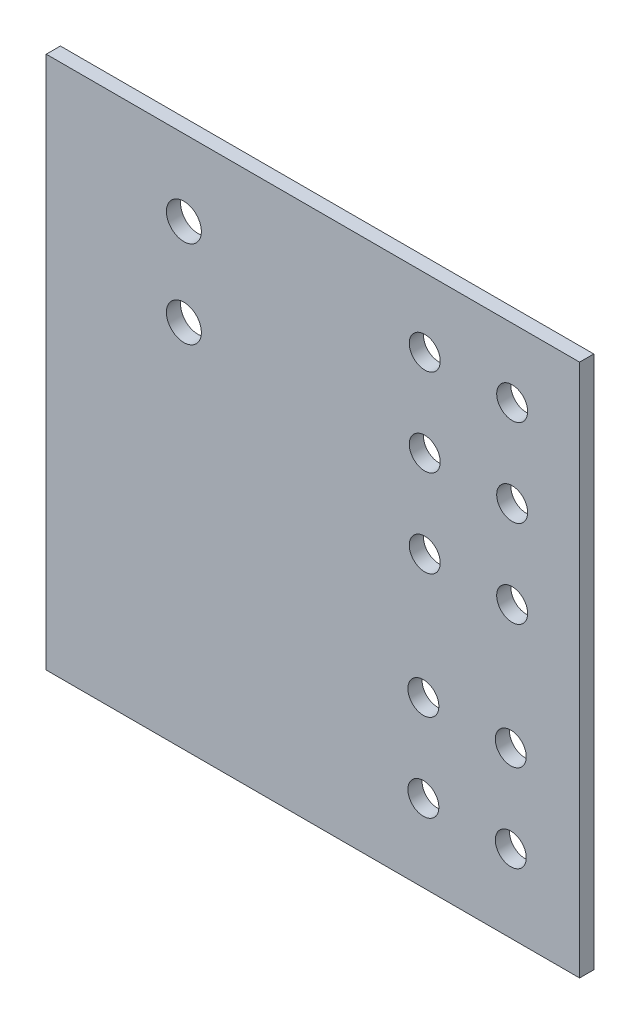
ISO-10303-21;
HEADER;
FILE_DESCRIPTION(('STEP AP214'),'2;1');
FILE_NAME('part.step','',(''),(''),'','','');
FILE_SCHEMA(('AUTOMOTIVE_DESIGN { 1 0 10303 214 1 1 1 1 }'));
ENDSEC;
DATA;
#1=APPLICATION_CONTEXT('core data for automotive mechanical design processes');
#2=APPLICATION_PROTOCOL_DEFINITION('international standard','automotive_design',2000,#1);
#3=PRODUCT_CONTEXT('',#1,'mechanical');
#4=PRODUCT('Part','Part','',(#3));
#5=PRODUCT_RELATED_PRODUCT_CATEGORY('part','',(#4));
#6=PRODUCT_DEFINITION_FORMATION('','',#4);
#7=PRODUCT_DEFINITION_CONTEXT('part definition',#1,'design');
#8=PRODUCT_DEFINITION('design','',#6,#7);
#9=PRODUCT_DEFINITION_SHAPE('','',#8);
#10=(LENGTH_UNIT() NAMED_UNIT(*) SI_UNIT(.MILLI.,.METRE.));
#11=(NAMED_UNIT(*) PLANE_ANGLE_UNIT() SI_UNIT($,.RADIAN.));
#12=(NAMED_UNIT(*) SI_UNIT($,.STERADIAN.) SOLID_ANGLE_UNIT());
#13=UNCERTAINTY_MEASURE_WITH_UNIT(LENGTH_MEASURE(1.E-05),#10,'distance_accuracy_value','');
#14=(GEOMETRIC_REPRESENTATION_CONTEXT(3) GLOBAL_UNCERTAINTY_ASSIGNED_CONTEXT((#13)) GLOBAL_UNIT_ASSIGNED_CONTEXT((#10,
#11,#12)) REPRESENTATION_CONTEXT('',''));
#15=CARTESIAN_POINT('',(0.,0.,0.));
#16=DIRECTION('',(0.,0.,1.));
#17=DIRECTION('',(1.,0.,0.));
#18=AXIS2_PLACEMENT_3D('',#15,#16,#17);
#19=CARTESIAN_POINT('',(0.,5.00000016,0.41148));
#20=DIRECTION('',(0.,0.,-1.));
#21=DIRECTION('',(-1.,0.,0.));
#22=AXIS2_PLACEMENT_3D('',#19,#20,#21);
#23=PLANE('',#22);
#24=CARTESIAN_POINT('',(13.54002626,13.5000238,0.41148));
#25=DIRECTION('',(0.,0.,-1.));
#26=DIRECTION('',(-1.,0.,0.));
#27=AXIS2_PLACEMENT_3D('',#24,#25,#26);
#28=CIRCLE('',#27,0.4499991);
#29=CARTESIAN_POINT('',(13.09002716,13.5000238,0.41148));
#30=VERTEX_POINT('',#29);
#31=EDGE_CURVE('E131',#30,#30,#28,.T.);
#32=ORIENTED_EDGE('',*,*,#31,.T.);
#33=EDGE_LOOP('',(#32));
#34=FACE_BOUND('',#33,.T.);
#35=CARTESIAN_POINT('',(13.54002626,10.9600238,0.41148));
#36=DIRECTION('',(0.,0.,-1.));
#37=DIRECTION('',(-1.,0.,0.));
#38=AXIS2_PLACEMENT_3D('',#35,#36,#37);
#39=CIRCLE('',#38,0.4499991);
#40=CARTESIAN_POINT('',(13.09002716,10.9600238,0.41148));
#41=VERTEX_POINT('',#40);
#42=EDGE_CURVE('E134',#41,#41,#39,.T.);
#43=ORIENTED_EDGE('',*,*,#42,.T.);
#44=EDGE_LOOP('',(#43));
#45=FACE_BOUND('',#44,.T.);
#46=CARTESIAN_POINT('',(11.00002626,10.9600238,0.41148));
#47=DIRECTION('',(0.,0.,-1.));
#48=DIRECTION('',(-1.,0.,0.));
#49=AXIS2_PLACEMENT_3D('',#46,#47,#48);
#50=CIRCLE('',#49,0.4499991);
#51=CARTESIAN_POINT('',(10.55002716,10.9600238,0.41148));
#52=VERTEX_POINT('',#51);
#53=EDGE_CURVE('E137',#52,#52,#50,.T.);
#54=ORIENTED_EDGE('',*,*,#53,.T.);
#55=EDGE_LOOP('',(#54));
#56=FACE_BOUND('',#55,.T.);
#57=CARTESIAN_POINT('',(13.54002626,8.4200238,0.41148));
#58=DIRECTION('',(0.,0.,-1.));
#59=DIRECTION('',(-1.,0.,0.));
#60=AXIS2_PLACEMENT_3D('',#57,#58,#59);
#61=CIRCLE('',#60,0.4499991);
#62=CARTESIAN_POINT('',(13.09002716,8.4200238,0.41148));
#63=VERTEX_POINT('',#62);
#64=EDGE_CURVE('E140',#63,#63,#61,.T.);
#65=ORIENTED_EDGE('',*,*,#64,.T.);
#66=EDGE_LOOP('',(#65));
#67=FACE_BOUND('',#66,.T.);
#68=CARTESIAN_POINT('',(13.49999586,4.7900082,0.41148));
#69=DIRECTION('',(0.,0.,-1.));
#70=DIRECTION('',(-1.,0.,0.));
#71=AXIS2_PLACEMENT_3D('',#68,#69,#70);
#72=CIRCLE('',#71,0.4499991);
#73=CARTESIAN_POINT('',(13.04999676,4.7900082,0.41148));
#74=VERTEX_POINT('',#73);
#75=EDGE_CURVE('E143',#74,#74,#72,.T.);
#76=ORIENTED_EDGE('',*,*,#75,.T.);
#77=EDGE_LOOP('',(#76));
#78=FACE_BOUND('',#77,.T.);
#79=CARTESIAN_POINT('',(13.49999586,2.2500082,0.41148));
#80=DIRECTION('',(0.,0.,-1.));
#81=DIRECTION('',(-1.,0.,0.));
#82=AXIS2_PLACEMENT_3D('',#79,#80,#81);
#83=CIRCLE('',#82,0.4499991);
#84=CARTESIAN_POINT('',(13.04999676,2.2500082,0.41148));
#85=VERTEX_POINT('',#84);
#86=EDGE_CURVE('E146',#85,#85,#83,.T.);
#87=ORIENTED_EDGE('',*,*,#86,.T.);
#88=EDGE_LOOP('',(#87));
#89=FACE_BOUND('',#88,.T.);
#90=CARTESIAN_POINT('',(11.00002626,13.5000238,0.41148));
#91=DIRECTION('',(0.,0.,-1.));
#92=DIRECTION('',(-1.,0.,0.));
#93=AXIS2_PLACEMENT_3D('',#90,#91,#92);
#94=CIRCLE('',#93,0.4499991);
#95=CARTESIAN_POINT('',(10.55002716,13.5000238,0.41148));
#96=VERTEX_POINT('',#95);
#97=EDGE_CURVE('E149',#96,#96,#94,.T.);
#98=ORIENTED_EDGE('',*,*,#97,.T.);
#99=EDGE_LOOP('',(#98));
#100=FACE_BOUND('',#99,.T.);
#101=CARTESIAN_POINT('',(3.99998946,13.2900166,0.41148));
#102=DIRECTION('',(0.,0.,-1.));
#103=DIRECTION('',(-1.,0.,0.));
#104=AXIS2_PLACEMENT_3D('',#101,#102,#103);
#105=CIRCLE('',#104,0.508);
#106=CARTESIAN_POINT('',(3.49198946,13.2900166,0.41148));
#107=VERTEX_POINT('',#106);
#108=EDGE_CURVE('E152',#107,#107,#105,.T.);
#109=ORIENTED_EDGE('',*,*,#108,.T.);
#110=EDGE_LOOP('',(#109));
#111=FACE_BOUND('',#110,.T.);
#112=CARTESIAN_POINT('',(3.99998946,10.7500166,0.41148));
#113=DIRECTION('',(0.,0.,-1.));
#114=DIRECTION('',(-1.,0.,0.));
#115=AXIS2_PLACEMENT_3D('',#112,#113,#114);
#116=CIRCLE('',#115,0.508);
#117=CARTESIAN_POINT('',(3.49198946,10.7500166,0.41148));
#118=VERTEX_POINT('',#117);
#119=EDGE_CURVE('E155',#118,#118,#116,.T.);
#120=ORIENTED_EDGE('',*,*,#119,.T.);
#121=EDGE_LOOP('',(#120));
#122=FACE_BOUND('',#121,.T.);
#123=CARTESIAN_POINT('',(11.00002626,8.4200238,0.41148));
#124=DIRECTION('',(0.,0.,-1.));
#125=DIRECTION('',(-1.,0.,0.));
#126=AXIS2_PLACEMENT_3D('',#123,#124,#125);
#127=CIRCLE('',#126,0.4499991);
#128=CARTESIAN_POINT('',(10.55002716,8.4200238,0.41148));
#129=VERTEX_POINT('',#128);
#130=EDGE_CURVE('E158',#129,#129,#127,.T.);
#131=ORIENTED_EDGE('',*,*,#130,.T.);
#132=EDGE_LOOP('',(#131));
#133=FACE_BOUND('',#132,.T.);
#134=CARTESIAN_POINT('',(10.95999586,4.7900082,0.41148));
#135=DIRECTION('',(0.,0.,-1.));
#136=DIRECTION('',(-1.,0.,0.));
#137=AXIS2_PLACEMENT_3D('',#134,#135,#136);
#138=CIRCLE('',#137,0.4499991);
#139=CARTESIAN_POINT('',(10.50999676,4.7900082,0.41148));
#140=VERTEX_POINT('',#139);
#141=EDGE_CURVE('E161',#140,#140,#138,.T.);
#142=ORIENTED_EDGE('',*,*,#141,.T.);
#143=EDGE_LOOP('',(#142));
#144=FACE_BOUND('',#143,.T.);
#145=CARTESIAN_POINT('',(10.95999586,2.2500082,0.41148));
#146=DIRECTION('',(0.,0.,-1.));
#147=DIRECTION('',(-1.,0.,0.));
#148=AXIS2_PLACEMENT_3D('',#145,#146,#147);
#149=CIRCLE('',#148,0.4499991);
#150=CARTESIAN_POINT('',(10.50999676,2.2500082,0.41148));
#151=VERTEX_POINT('',#150);
#152=EDGE_CURVE('E164',#151,#151,#149,.T.);
#153=ORIENTED_EDGE('',*,*,#152,.T.);
#154=EDGE_LOOP('',(#153));
#155=FACE_BOUND('',#154,.T.);
#156=DIRECTION('',(0.999999999999879,-4.91612758596341E-07,0.));
#157=VECTOR('',#156,1.);
#158=CARTESIAN_POINT('',(-2.45806512033647E-06,-2.54000004189237E-06,0.41148));
#159=LINE('',#158,#157);
#160=CARTESIAN_POINT('',(-2.53999999999976E-06,-2.54000000081413E-06,0.41148));
#161=VERTEX_POINT('',#160);
#162=CARTESIAN_POINT('',(15.50000202,-1.01600000014975E-05,0.41148));
#163=VERTEX_POINT('',#162);
#164=EDGE_CURVE('E169',#161,#163,#159,.T.);
#165=ORIENTED_EDGE('',*,*,#164,.T.);
#166=DIRECTION('',(-4.91612678027341E-07,0.999999999999879,0.));
#167=VECTOR('',#166,1.);
#168=CARTESIAN_POINT('',(15.4999995619278,5.00000777999629,0.41148));
#169=LINE('',#168,#167);
#170=CARTESIAN_POINT('',(15.4999944,15.49999694,0.41148));
#171=VERTEX_POINT('',#170);
#172=EDGE_CURVE('E66',#163,#171,#169,.T.);
#173=ORIENTED_EDGE('',*,*,#172,.T.);
#174=DIRECTION('',(-0.999999999999785,6.55483785498184E-07,0.));
#175=VECTOR('',#174,1.);
#176=CARTESIAN_POINT('',(15.4999944,15.49999694,0.41148));
#177=LINE('',#176,#175);
#178=CARTESIAN_POINT('',(-7.61999999908746E-06,15.5000071,0.41148));
#179=VERTEX_POINT('',#178);
#180=EDGE_CURVE('E62',#171,#179,#177,.T.);
#181=ORIENTED_EDGE('',*,*,#180,.T.);
#182=DIRECTION('',(7.25713806051609E-07,-0.999999999999737,0.));
#183=VECTOR('',#182,1.);
#184=CARTESIAN_POINT('',(0.,5.00000016,0.41148));
#185=LINE('',#184,#183);
#186=CARTESIAN_POINT('',(0.,5.00000015999907,0.41148));
#187=VERTEX_POINT('',#186);
#188=EDGE_CURVE('E20',#179,#187,#185,.T.);
#189=ORIENTED_EDGE('',*,*,#188,.T.);
#190=DIRECTION('',(-5.07999725680034E-07,-0.999999999999871,0.));
#191=VECTOR('',#190,1.);
#192=CARTESIAN_POINT('',(0.,5.00000016,0.41148));
#193=LINE('',#192,#191);
#194=EDGE_CURVE('E167',#187,#161,#193,.T.);
#195=ORIENTED_EDGE('',*,*,#194,.T.);
#196=EDGE_LOOP('',(#165,#173,#181,#189,#195));
#197=FACE_BOUND('',#196,.T.);
#198=ADVANCED_FACE('F17',(#34,#45,#56,#67,#78,#89,#100,#111,#122,#133,#144,#155,#197),#23,.F.);
#199=CARTESIAN_POINT('',(-7.62E-06,15.5000071,0.));
#200=DIRECTION('',(0.999999999999737,7.25713806051609E-07,0.));
#201=DIRECTION('',(-7.25713806051609E-07,0.999999999999737,0.));
#202=AXIS2_PLACEMENT_3D('',#199,#200,#201);
#203=PLANE('',#202);
#204=DIRECTION('',(0.,0.,1.));
#205=VECTOR('',#204,1.);
#206=CARTESIAN_POINT('',(0.,5.00000016,0.));
#207=LINE('',#206,#205);
#208=CARTESIAN_POINT('',(0.,5.00000016000018,0.));
#209=VERTEX_POINT('',#208);
#210=EDGE_CURVE('E75',#209,#187,#207,.T.);
#211=ORIENTED_EDGE('',*,*,#210,.T.);
#212=ORIENTED_EDGE('',*,*,#188,.F.);
#213=DIRECTION('',(0.,0.,1.));
#214=VECTOR('',#213,1.);
#215=CARTESIAN_POINT('',(-7.61999999904228E-06,15.5000071,0.));
#216=LINE('',#215,#214);
#217=CARTESIAN_POINT('',(-7.61999999952114E-06,15.5000071,0.));
#218=VERTEX_POINT('',#217);
#219=EDGE_CURVE('E70',#179,#218,#216,.F.);
#220=ORIENTED_EDGE('',*,*,#219,.T.);
#221=DIRECTION('',(-7.25713806051609E-07,0.999999999999737,0.));
#222=VECTOR('',#221,1.);
#223=CARTESIAN_POINT('',(-7.62E-06,15.5000071,0.));
#224=LINE('',#223,#222);
#225=EDGE_CURVE('E129',#209,#218,#224,.T.);
#226=ORIENTED_EDGE('',*,*,#225,.F.);
#227=EDGE_LOOP('',(#211,#212,#220,#226));
#228=FACE_BOUND('',#227,.T.);
#229=ADVANCED_FACE('F72',(#228),#203,.F.);
#230=CARTESIAN_POINT('',(15.4999944,15.49999694,0.));
#231=DIRECTION('',(-6.55483785455959E-07,-0.999999999999785,0.));
#232=DIRECTION('',(0.999999999999785,-6.55483785455959E-07,0.));
#233=AXIS2_PLACEMENT_3D('',#230,#231,#232);
#234=PLANE('',#233);
#235=ORIENTED_EDGE('',*,*,#219,.F.);
#236=ORIENTED_EDGE('',*,*,#180,.F.);
#237=DIRECTION('',(0.,0.,1.));
#238=VECTOR('',#237,1.);
#239=CARTESIAN_POINT('',(15.4999944,15.49999694,0.));
#240=LINE('',#239,#238);
#241=CARTESIAN_POINT('',(15.4999944,15.49999694,0.));
#242=VERTEX_POINT('',#241);
#243=EDGE_CURVE('E82',#171,#242,#240,.F.);
#244=ORIENTED_EDGE('',*,*,#243,.T.);
#245=DIRECTION('',(0.999999999999785,-6.55483785419657E-07,0.));
#246=VECTOR('',#245,1.);
#247=CARTESIAN_POINT('',(0.,15.500007099995,0.));
#248=LINE('',#247,#246);
#249=EDGE_CURVE('E79',#218,#242,#248,.T.);
#250=ORIENTED_EDGE('',*,*,#249,.F.);
#251=EDGE_LOOP('',(#235,#236,#244,#250));
#252=FACE_BOUND('',#251,.T.);
#253=ADVANCED_FACE('F77',(#252),#234,.F.);
#254=CARTESIAN_POINT('',(15.50000202,-1.016E-05,0.));
#255=DIRECTION('',(-0.999999999999879,-4.91612678027341E-07,0.));
#256=DIRECTION('',(4.91612678027341E-07,-0.999999999999879,0.));
#257=AXIS2_PLACEMENT_3D('',#254,#255,#256);
#258=PLANE('',#257);
#259=ORIENTED_EDGE('',*,*,#243,.F.);
#260=ORIENTED_EDGE('',*,*,#172,.F.);
#261=DIRECTION('',(0.,0.,1.));
#262=VECTOR('',#261,1.);
#263=CARTESIAN_POINT('',(15.50000202,-1.01599999999984E-05,0.));
#264=LINE('',#263,#262);
#265=CARTESIAN_POINT('',(15.50000202,-1.01599999999984E-05,0.));
#266=VERTEX_POINT('',#265);
#267=EDGE_CURVE('E170',#163,#266,#264,.F.);
#268=ORIENTED_EDGE('',*,*,#267,.T.);
#269=DIRECTION('',(4.91612678027341E-07,-0.999999999999879,0.));
#270=VECTOR('',#269,1.);
#271=CARTESIAN_POINT('',(15.50000202,-1.016E-05,0.));
#272=LINE('',#271,#270);
#273=EDGE_CURVE('E125',#242,#266,#272,.T.);
#274=ORIENTED_EDGE('',*,*,#273,.F.);
#275=EDGE_LOOP('',(#259,#260,#268,#274));
#276=FACE_BOUND('',#275,.T.);
#277=ADVANCED_FACE('F173',(#276),#258,.F.);
#278=CARTESIAN_POINT('',(-2.54E-06,-2.54E-06,0.));
#279=DIRECTION('',(4.91612758596341E-07,0.999999999999879,0.));
#280=DIRECTION('',(-0.999999999999879,4.91612758596341E-07,0.));
#281=AXIS2_PLACEMENT_3D('',#278,#279,#280);
#282=PLANE('',#281);
#283=ORIENTED_EDGE('',*,*,#267,.F.);
#284=ORIENTED_EDGE('',*,*,#164,.F.);
#285=DIRECTION('',(0.,0.,1.));
#286=VECTOR('',#285,1.);
#287=CARTESIAN_POINT('',(-2.53999999999976E-06,-2.540000000259E-06,0.));
#288=LINE('',#287,#286);
#289=CARTESIAN_POINT('',(-2.53999999999976E-06,-2.53999999997741E-06,0.));
#290=VERTEX_POINT('',#289);
#291=EDGE_CURVE('E35',#161,#290,#288,.F.);
#292=ORIENTED_EDGE('',*,*,#291,.T.);
#293=DIRECTION('',(-0.999999999999879,4.91612758596341E-07,0.));
#294=VECTOR('',#293,1.);
#295=CARTESIAN_POINT('',(-2.54E-06,-2.54E-06,0.));
#296=LINE('',#295,#294);
#297=EDGE_CURVE('E122',#266,#290,#296,.T.);
#298=ORIENTED_EDGE('',*,*,#297,.F.);
#299=EDGE_LOOP('',(#283,#284,#292,#298));
#300=FACE_BOUND('',#299,.T.);
#301=ADVANCED_FACE('F181',(#300),#282,.F.);
#302=CARTESIAN_POINT('',(0.,5.00000016,0.));
#303=DIRECTION('',(0.999999999999871,-5.07999725680034E-07,0.));
#304=DIRECTION('',(5.07999725680034E-07,0.999999999999871,0.));
#305=AXIS2_PLACEMENT_3D('',#302,#303,#304);
#306=PLANE('',#305);
#307=ORIENTED_EDGE('',*,*,#291,.F.);
#308=ORIENTED_EDGE('',*,*,#194,.F.);
#309=ORIENTED_EDGE('',*,*,#210,.F.);
#310=DIRECTION('',(5.07999725680034E-07,0.999999999999871,0.));
#311=VECTOR('',#310,1.);
#312=CARTESIAN_POINT('',(0.,5.00000016,0.));
#313=LINE('',#312,#311);
#314=EDGE_CURVE('E119',#290,#209,#313,.T.);
#315=ORIENTED_EDGE('',*,*,#314,.F.);
#316=EDGE_LOOP('',(#307,#308,#309,#315));
#317=FACE_BOUND('',#316,.T.);
#318=ADVANCED_FACE('F178',(#317),#306,.F.);
#319=CARTESIAN_POINT('',(10.95999586,2.2500082,0.));
#320=DIRECTION('',(0.,0.,-1.));
#321=DIRECTION('',(-1.,0.,0.));
#322=AXIS2_PLACEMENT_3D('',#319,#320,#321);
#323=CYLINDRICAL_SURFACE('',#322,0.4499991);
#324=ORIENTED_EDGE('',*,*,#152,.F.);
#325=EDGE_LOOP('',(#324));
#326=FACE_BOUND('',#325,.T.);
#327=CARTESIAN_POINT('',(10.95999586,2.2500082,0.));
#328=DIRECTION('',(0.,0.,-1.));
#329=DIRECTION('',(-1.,0.,0.));
#330=AXIS2_PLACEMENT_3D('',#327,#328,#329);
#331=CIRCLE('',#330,0.4499991);
#332=CARTESIAN_POINT('',(10.50999676,2.2500082,0.));
#333=VERTEX_POINT('',#332);
#334=EDGE_CURVE('E116',#333,#333,#331,.F.);
#335=ORIENTED_EDGE('',*,*,#334,.F.);
#336=EDGE_LOOP('',(#335));
#337=FACE_BOUND('',#336,.T.);
#338=ADVANCED_FACE('F189',(#326,#337),#323,.F.);
#339=CARTESIAN_POINT('',(10.95999586,4.7900082,0.));
#340=DIRECTION('',(0.,0.,-1.));
#341=DIRECTION('',(-1.,0.,0.));
#342=AXIS2_PLACEMENT_3D('',#339,#340,#341);
#343=CYLINDRICAL_SURFACE('',#342,0.4499991);
#344=ORIENTED_EDGE('',*,*,#141,.F.);
#345=EDGE_LOOP('',(#344));
#346=FACE_BOUND('',#345,.T.);
#347=CARTESIAN_POINT('',(10.95999586,4.7900082,0.));
#348=DIRECTION('',(0.,0.,-1.));
#349=DIRECTION('',(-1.,0.,0.));
#350=AXIS2_PLACEMENT_3D('',#347,#348,#349);
#351=CIRCLE('',#350,0.4499991);
#352=CARTESIAN_POINT('',(10.50999676,4.7900082,0.));
#353=VERTEX_POINT('',#352);
#354=EDGE_CURVE('E113',#353,#353,#351,.F.);
#355=ORIENTED_EDGE('',*,*,#354,.F.);
#356=EDGE_LOOP('',(#355));
#357=FACE_BOUND('',#356,.T.);
#358=ADVANCED_FACE('F238',(#346,#357),#343,.F.);
#359=CARTESIAN_POINT('',(11.00002626,8.4200238,0.));
#360=DIRECTION('',(0.,0.,-1.));
#361=DIRECTION('',(-1.,0.,0.));
#362=AXIS2_PLACEMENT_3D('',#359,#360,#361);
#363=CYLINDRICAL_SURFACE('',#362,0.4499991);
#364=ORIENTED_EDGE('',*,*,#130,.F.);
#365=EDGE_LOOP('',(#364));
#366=FACE_BOUND('',#365,.T.);
#367=CARTESIAN_POINT('',(11.00002626,8.4200238,0.));
#368=DIRECTION('',(0.,0.,-1.));
#369=DIRECTION('',(-1.,0.,0.));
#370=AXIS2_PLACEMENT_3D('',#367,#368,#369);
#371=CIRCLE('',#370,0.4499991);
#372=CARTESIAN_POINT('',(10.55002716,8.4200238,0.));
#373=VERTEX_POINT('',#372);
#374=EDGE_CURVE('E110',#373,#373,#371,.F.);
#375=ORIENTED_EDGE('',*,*,#374,.F.);
#376=EDGE_LOOP('',(#375));
#377=FACE_BOUND('',#376,.T.);
#378=ADVANCED_FACE('F234',(#366,#377),#363,.F.);
#379=CARTESIAN_POINT('',(3.99998946,10.7500166,0.));
#380=DIRECTION('',(0.,0.,-1.));
#381=DIRECTION('',(-1.,0.,0.));
#382=AXIS2_PLACEMENT_3D('',#379,#380,#381);
#383=CYLINDRICAL_SURFACE('',#382,0.508);
#384=ORIENTED_EDGE('',*,*,#119,.F.);
#385=EDGE_LOOP('',(#384));
#386=FACE_BOUND('',#385,.T.);
#387=CARTESIAN_POINT('',(3.99998946,10.7500166,0.));
#388=DIRECTION('',(0.,0.,-1.));
#389=DIRECTION('',(-1.,0.,0.));
#390=AXIS2_PLACEMENT_3D('',#387,#388,#389);
#391=CIRCLE('',#390,0.508);
#392=CARTESIAN_POINT('',(3.49198946,10.7500166,0.));
#393=VERTEX_POINT('',#392);
#394=EDGE_CURVE('E107',#393,#393,#391,.F.);
#395=ORIENTED_EDGE('',*,*,#394,.F.);
#396=EDGE_LOOP('',(#395));
#397=FACE_BOUND('',#396,.T.);
#398=ADVANCED_FACE('F230',(#386,#397),#383,.F.);
#399=CARTESIAN_POINT('',(3.99998946,13.2900166,0.));
#400=DIRECTION('',(0.,0.,-1.));
#401=DIRECTION('',(-1.,0.,0.));
#402=AXIS2_PLACEMENT_3D('',#399,#400,#401);
#403=CYLINDRICAL_SURFACE('',#402,0.508);
#404=ORIENTED_EDGE('',*,*,#108,.F.);
#405=EDGE_LOOP('',(#404));
#406=FACE_BOUND('',#405,.T.);
#407=CARTESIAN_POINT('',(3.99998946,13.2900166,0.));
#408=DIRECTION('',(0.,0.,-1.));
#409=DIRECTION('',(-1.,0.,0.));
#410=AXIS2_PLACEMENT_3D('',#407,#408,#409);
#411=CIRCLE('',#410,0.508);
#412=CARTESIAN_POINT('',(3.49198946,13.2900166,0.));
#413=VERTEX_POINT('',#412);
#414=EDGE_CURVE('E104',#413,#413,#411,.F.);
#415=ORIENTED_EDGE('',*,*,#414,.F.);
#416=EDGE_LOOP('',(#415));
#417=FACE_BOUND('',#416,.T.);
#418=ADVANCED_FACE('F226',(#406,#417),#403,.F.);
#419=CARTESIAN_POINT('',(11.00002626,13.5000238,0.));
#420=DIRECTION('',(0.,0.,-1.));
#421=DIRECTION('',(-1.,0.,0.));
#422=AXIS2_PLACEMENT_3D('',#419,#420,#421);
#423=CYLINDRICAL_SURFACE('',#422,0.4499991);
#424=ORIENTED_EDGE('',*,*,#97,.F.);
#425=EDGE_LOOP('',(#424));
#426=FACE_BOUND('',#425,.T.);
#427=CARTESIAN_POINT('',(11.00002626,13.5000238,0.));
#428=DIRECTION('',(0.,0.,-1.));
#429=DIRECTION('',(-1.,0.,0.));
#430=AXIS2_PLACEMENT_3D('',#427,#428,#429);
#431=CIRCLE('',#430,0.4499991);
#432=CARTESIAN_POINT('',(10.55002716,13.5000238,0.));
#433=VERTEX_POINT('',#432);
#434=EDGE_CURVE('E101',#433,#433,#431,.F.);
#435=ORIENTED_EDGE('',*,*,#434,.F.);
#436=EDGE_LOOP('',(#435));
#437=FACE_BOUND('',#436,.T.);
#438=ADVANCED_FACE('F222',(#426,#437),#423,.F.);
#439=CARTESIAN_POINT('',(13.49999586,2.2500082,0.));
#440=DIRECTION('',(0.,0.,-1.));
#441=DIRECTION('',(-1.,0.,0.));
#442=AXIS2_PLACEMENT_3D('',#439,#440,#441);
#443=CYLINDRICAL_SURFACE('',#442,0.4499991);
#444=ORIENTED_EDGE('',*,*,#86,.F.);
#445=EDGE_LOOP('',(#444));
#446=FACE_BOUND('',#445,.T.);
#447=CARTESIAN_POINT('',(13.49999586,2.2500082,0.));
#448=DIRECTION('',(0.,0.,-1.));
#449=DIRECTION('',(-1.,0.,0.));
#450=AXIS2_PLACEMENT_3D('',#447,#448,#449);
#451=CIRCLE('',#450,0.4499991);
#452=CARTESIAN_POINT('',(13.04999676,2.2500082,0.));
#453=VERTEX_POINT('',#452);
#454=EDGE_CURVE('E98',#453,#453,#451,.F.);
#455=ORIENTED_EDGE('',*,*,#454,.F.);
#456=EDGE_LOOP('',(#455));
#457=FACE_BOUND('',#456,.T.);
#458=ADVANCED_FACE('F218',(#446,#457),#443,.F.);
#459=CARTESIAN_POINT('',(13.49999586,4.7900082,0.));
#460=DIRECTION('',(0.,0.,-1.));
#461=DIRECTION('',(-1.,0.,0.));
#462=AXIS2_PLACEMENT_3D('',#459,#460,#461);
#463=CYLINDRICAL_SURFACE('',#462,0.4499991);
#464=ORIENTED_EDGE('',*,*,#75,.F.);
#465=EDGE_LOOP('',(#464));
#466=FACE_BOUND('',#465,.T.);
#467=CARTESIAN_POINT('',(13.49999586,4.7900082,0.));
#468=DIRECTION('',(0.,0.,-1.));
#469=DIRECTION('',(-1.,0.,0.));
#470=AXIS2_PLACEMENT_3D('',#467,#468,#469);
#471=CIRCLE('',#470,0.4499991);
#472=CARTESIAN_POINT('',(13.04999676,4.7900082,0.));
#473=VERTEX_POINT('',#472);
#474=EDGE_CURVE('E95',#473,#473,#471,.F.);
#475=ORIENTED_EDGE('',*,*,#474,.F.);
#476=EDGE_LOOP('',(#475));
#477=FACE_BOUND('',#476,.T.);
#478=ADVANCED_FACE('F214',(#466,#477),#463,.F.);
#479=CARTESIAN_POINT('',(13.54002626,8.4200238,0.));
#480=DIRECTION('',(0.,0.,-1.));
#481=DIRECTION('',(-1.,0.,0.));
#482=AXIS2_PLACEMENT_3D('',#479,#480,#481);
#483=CYLINDRICAL_SURFACE('',#482,0.4499991);
#484=ORIENTED_EDGE('',*,*,#64,.F.);
#485=EDGE_LOOP('',(#484));
#486=FACE_BOUND('',#485,.T.);
#487=CARTESIAN_POINT('',(13.54002626,8.4200238,0.));
#488=DIRECTION('',(0.,0.,-1.));
#489=DIRECTION('',(-1.,0.,0.));
#490=AXIS2_PLACEMENT_3D('',#487,#488,#489);
#491=CIRCLE('',#490,0.4499991);
#492=CARTESIAN_POINT('',(13.09002716,8.4200238,0.));
#493=VERTEX_POINT('',#492);
#494=EDGE_CURVE('E92',#493,#493,#491,.F.);
#495=ORIENTED_EDGE('',*,*,#494,.F.);
#496=EDGE_LOOP('',(#495));
#497=FACE_BOUND('',#496,.T.);
#498=ADVANCED_FACE('F210',(#486,#497),#483,.F.);
#499=CARTESIAN_POINT('',(11.00002626,10.9600238,0.));
#500=DIRECTION('',(0.,0.,-1.));
#501=DIRECTION('',(-1.,0.,0.));
#502=AXIS2_PLACEMENT_3D('',#499,#500,#501);
#503=CYLINDRICAL_SURFACE('',#502,0.4499991);
#504=ORIENTED_EDGE('',*,*,#53,.F.);
#505=EDGE_LOOP('',(#504));
#506=FACE_BOUND('',#505,.T.);
#507=CARTESIAN_POINT('',(11.00002626,10.9600238,0.));
#508=DIRECTION('',(0.,0.,-1.));
#509=DIRECTION('',(-1.,0.,0.));
#510=AXIS2_PLACEMENT_3D('',#507,#508,#509);
#511=CIRCLE('',#510,0.4499991);
#512=CARTESIAN_POINT('',(10.55002716,10.9600238,0.));
#513=VERTEX_POINT('',#512);
#514=EDGE_CURVE('E89',#513,#513,#511,.F.);
#515=ORIENTED_EDGE('',*,*,#514,.F.);
#516=EDGE_LOOP('',(#515));
#517=FACE_BOUND('',#516,.T.);
#518=ADVANCED_FACE('F206',(#506,#517),#503,.F.);
#519=CARTESIAN_POINT('',(13.54002626,10.9600238,0.));
#520=DIRECTION('',(0.,0.,-1.));
#521=DIRECTION('',(-1.,0.,0.));
#522=AXIS2_PLACEMENT_3D('',#519,#520,#521);
#523=CYLINDRICAL_SURFACE('',#522,0.4499991);
#524=ORIENTED_EDGE('',*,*,#42,.F.);
#525=EDGE_LOOP('',(#524));
#526=FACE_BOUND('',#525,.T.);
#527=CARTESIAN_POINT('',(13.54002626,10.9600238,0.));
#528=DIRECTION('',(0.,0.,-1.));
#529=DIRECTION('',(-1.,0.,0.));
#530=AXIS2_PLACEMENT_3D('',#527,#528,#529);
#531=CIRCLE('',#530,0.4499991);
#532=CARTESIAN_POINT('',(13.09002716,10.9600238,0.));
#533=VERTEX_POINT('',#532);
#534=EDGE_CURVE('E26',#533,#533,#531,.F.);
#535=ORIENTED_EDGE('',*,*,#534,.F.);
#536=EDGE_LOOP('',(#535));
#537=FACE_BOUND('',#536,.T.);
#538=ADVANCED_FACE('F199',(#526,#537),#523,.F.);
#539=CARTESIAN_POINT('',(13.54002626,13.5000238,0.));
#540=DIRECTION('',(0.,0.,-1.));
#541=DIRECTION('',(-1.,0.,0.));
#542=AXIS2_PLACEMENT_3D('',#539,#540,#541);
#543=CYLINDRICAL_SURFACE('',#542,0.4499991);
#544=ORIENTED_EDGE('',*,*,#31,.F.);
#545=EDGE_LOOP('',(#544));
#546=FACE_BOUND('',#545,.T.);
#547=CARTESIAN_POINT('',(13.54002626,13.5000238,0.));
#548=DIRECTION('',(0.,0.,-1.));
#549=DIRECTION('',(-1.,0.,0.));
#550=AXIS2_PLACEMENT_3D('',#547,#548,#549);
#551=CIRCLE('',#550,0.4499991);
#552=CARTESIAN_POINT('',(13.09002716,13.5000238,0.));
#553=VERTEX_POINT('',#552);
#554=EDGE_CURVE('E11',#553,#553,#551,.F.);
#555=ORIENTED_EDGE('',*,*,#554,.F.);
#556=EDGE_LOOP('',(#555));
#557=FACE_BOUND('',#556,.T.);
#558=ADVANCED_FACE('F193',(#546,#557),#543,.F.);
#559=CARTESIAN_POINT('',(0.,5.00000016,0.));
#560=DIRECTION('',(0.,0.,-1.));
#561=DIRECTION('',(-1.,0.,0.));
#562=AXIS2_PLACEMENT_3D('',#559,#560,#561);
#563=PLANE('',#562);
#564=ORIENTED_EDGE('',*,*,#554,.T.);
#565=EDGE_LOOP('',(#564));
#566=FACE_BOUND('',#565,.T.);
#567=ORIENTED_EDGE('',*,*,#534,.T.);
#568=EDGE_LOOP('',(#567));
#569=FACE_BOUND('',#568,.T.);
#570=ORIENTED_EDGE('',*,*,#514,.T.);
#571=EDGE_LOOP('',(#570));
#572=FACE_BOUND('',#571,.T.);
#573=ORIENTED_EDGE('',*,*,#494,.T.);
#574=EDGE_LOOP('',(#573));
#575=FACE_BOUND('',#574,.T.);
#576=ORIENTED_EDGE('',*,*,#474,.T.);
#577=EDGE_LOOP('',(#576));
#578=FACE_BOUND('',#577,.T.);
#579=ORIENTED_EDGE('',*,*,#454,.T.);
#580=EDGE_LOOP('',(#579));
#581=FACE_BOUND('',#580,.T.);
#582=ORIENTED_EDGE('',*,*,#434,.T.);
#583=EDGE_LOOP('',(#582));
#584=FACE_BOUND('',#583,.T.);
#585=ORIENTED_EDGE('',*,*,#414,.T.);
#586=EDGE_LOOP('',(#585));
#587=FACE_BOUND('',#586,.T.);
#588=ORIENTED_EDGE('',*,*,#394,.T.);
#589=EDGE_LOOP('',(#588));
#590=FACE_BOUND('',#589,.T.);
#591=ORIENTED_EDGE('',*,*,#374,.T.);
#592=EDGE_LOOP('',(#591));
#593=FACE_BOUND('',#592,.T.);
#594=ORIENTED_EDGE('',*,*,#354,.T.);
#595=EDGE_LOOP('',(#594));
#596=FACE_BOUND('',#595,.T.);
#597=ORIENTED_EDGE('',*,*,#334,.T.);
#598=EDGE_LOOP('',(#597));
#599=FACE_BOUND('',#598,.T.);
#600=ORIENTED_EDGE('',*,*,#297,.T.);
#601=ORIENTED_EDGE('',*,*,#314,.T.);
#602=ORIENTED_EDGE('',*,*,#225,.T.);
#603=ORIENTED_EDGE('',*,*,#249,.T.);
#604=ORIENTED_EDGE('',*,*,#273,.T.);
#605=EDGE_LOOP('',(#600,#601,#602,#603,#604));
#606=FACE_BOUND('',#605,.T.);
#607=ADVANCED_FACE('F176',(#566,#569,#572,#575,#578,#581,#584,#587,#590,#593,#596,#599,#606),
#563,.T.);
#608=CLOSED_SHELL('',(#198,#229,#253,#277,#301,#318,#338,#358,#378,#398,#418,#438,#458,#478,
#498,#518,#538,#558,#607));
#609=MANIFOLD_SOLID_BREP('B1',#608);
#610=ADVANCED_BREP_SHAPE_REPRESENTATION('',(#18,#609),#14);
#611=SHAPE_DEFINITION_REPRESENTATION(#9,#610);
ENDSEC;
END-ISO-10303-21;
